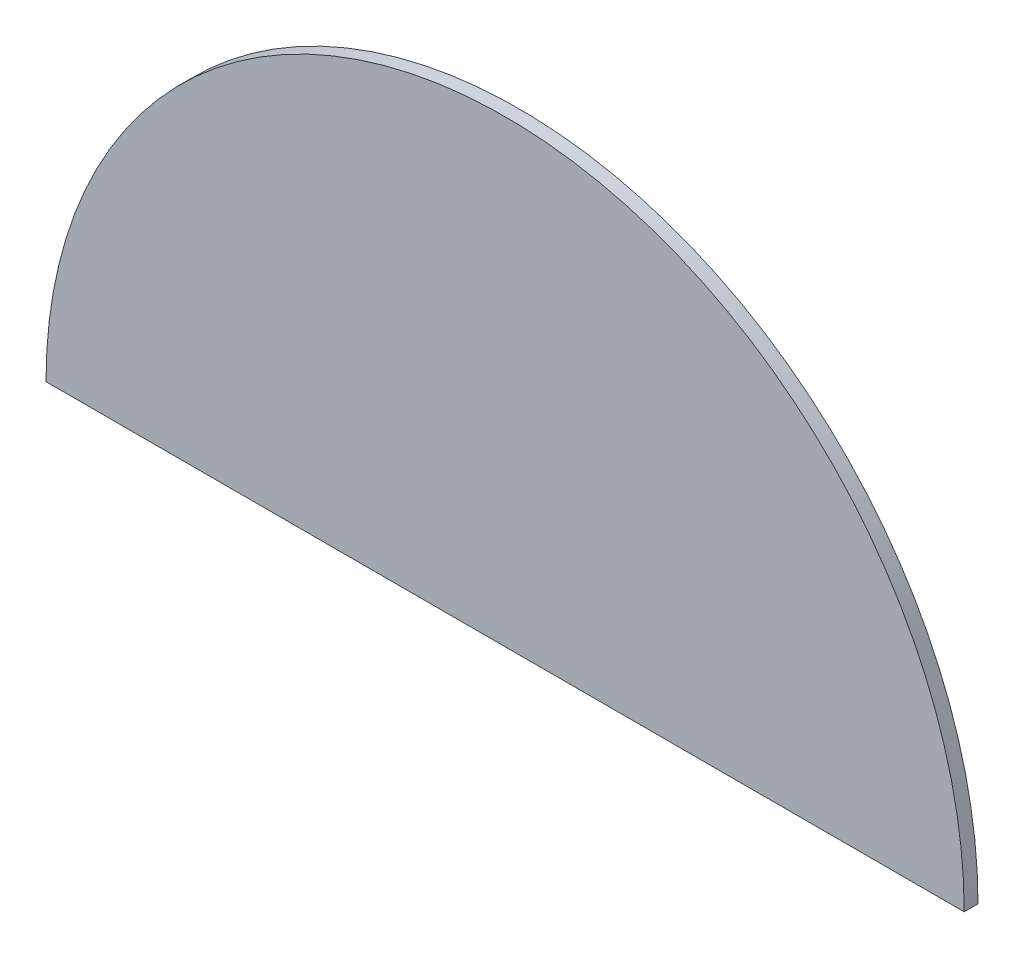
ISO-10303-21;
HEADER;
FILE_DESCRIPTION(('STEP AP214'),'2;1');
FILE_NAME('part.step','',(''),(''),'','','');
FILE_SCHEMA(('AUTOMOTIVE_DESIGN { 1 0 10303 214 1 1 1 1 }'));
ENDSEC;
DATA;
#1=APPLICATION_CONTEXT('core data for automotive mechanical design processes');
#2=APPLICATION_PROTOCOL_DEFINITION('international standard','automotive_design',2000,#1);
#3=PRODUCT_CONTEXT('',#1,'mechanical');
#4=PRODUCT('Part','Part','',(#3));
#5=PRODUCT_RELATED_PRODUCT_CATEGORY('part','',(#4));
#6=PRODUCT_DEFINITION_FORMATION('','',#4);
#7=PRODUCT_DEFINITION_CONTEXT('part definition',#1,'design');
#8=PRODUCT_DEFINITION('design','',#6,#7);
#9=PRODUCT_DEFINITION_SHAPE('','',#8);
#10=(LENGTH_UNIT() NAMED_UNIT(*) SI_UNIT(.MILLI.,.METRE.));
#11=(NAMED_UNIT(*) PLANE_ANGLE_UNIT() SI_UNIT($,.RADIAN.));
#12=(NAMED_UNIT(*) SI_UNIT($,.STERADIAN.) SOLID_ANGLE_UNIT());
#13=UNCERTAINTY_MEASURE_WITH_UNIT(LENGTH_MEASURE(1.E-05),#10,'distance_accuracy_value','');
#14=(GEOMETRIC_REPRESENTATION_CONTEXT(3) GLOBAL_UNCERTAINTY_ASSIGNED_CONTEXT((#13)) GLOBAL_UNIT_ASSIGNED_CONTEXT((#10,
#11,#12)) REPRESENTATION_CONTEXT('',''));
#15=CARTESIAN_POINT('',(0.,0.,0.));
#16=DIRECTION('',(0.,0.,1.));
#17=DIRECTION('',(1.,0.,0.));
#18=AXIS2_PLACEMENT_3D('',#15,#16,#17);
#19=CARTESIAN_POINT('',(0.,0.,3.));
#20=DIRECTION('',(0.,0.,-1.));
#21=DIRECTION('',(-1.,0.,0.));
#22=AXIS2_PLACEMENT_3D('',#19,#20,#21);
#23=CYLINDRICAL_SURFACE('',#22,100.);
#24=CARTESIAN_POINT('',(0.,0.,0.));
#25=DIRECTION('',(0.,0.,1.));
#26=DIRECTION('',(-1.,0.,0.));
#27=AXIS2_PLACEMENT_3D('',#24,#25,#26);
#28=CIRCLE('',#27,100.);
#29=CARTESIAN_POINT('',(100.,0.,0.));
#30=VERTEX_POINT('',#29);
#31=CARTESIAN_POINT('',(-100.,0.,0.));
#32=VERTEX_POINT('',#31);
#33=EDGE_CURVE('E62',#30,#32,#28,.T.);
#34=ORIENTED_EDGE('',*,*,#33,.T.);
#35=DIRECTION('',(0.,0.,-1.));
#36=VECTOR('',#35,1.);
#37=CARTESIAN_POINT('',(-100.,0.,3.));
#38=LINE('',#37,#36);
#39=CARTESIAN_POINT('',(-100.,0.,3.));
#40=VERTEX_POINT('',#39);
#41=EDGE_CURVE('E11',#40,#32,#38,.T.);
#42=ORIENTED_EDGE('',*,*,#41,.F.);
#43=CARTESIAN_POINT('',(0.,0.,3.));
#44=DIRECTION('',(0.,0.,1.));
#45=DIRECTION('',(-1.,0.,0.));
#46=AXIS2_PLACEMENT_3D('',#43,#44,#45);
#47=CIRCLE('',#46,100.);
#48=CARTESIAN_POINT('',(100.,0.,3.));
#49=VERTEX_POINT('',#48);
#50=EDGE_CURVE('E61',#49,#40,#47,.T.);
#51=ORIENTED_EDGE('',*,*,#50,.F.);
#52=DIRECTION('',(0.,0.,-1.));
#53=VECTOR('',#52,1.);
#54=CARTESIAN_POINT('',(100.,0.,3.));
#55=LINE('',#54,#53);
#56=EDGE_CURVE('E39',#49,#30,#55,.T.);
#57=ORIENTED_EDGE('',*,*,#56,.T.);
#58=EDGE_LOOP('',(#34,#42,#51,#57));
#59=FACE_BOUND('',#58,.T.);
#60=ADVANCED_FACE('F31',(#59),#23,.T.);
#61=CARTESIAN_POINT('',(-100.,0.,3.));
#62=DIRECTION('',(0.,1.,0.));
#63=DIRECTION('',(0.,0.,1.));
#64=AXIS2_PLACEMENT_3D('',#61,#62,#63);
#65=PLANE('',#64);
#66=DIRECTION('',(1.,0.,0.));
#67=VECTOR('',#66,1.);
#68=CARTESIAN_POINT('',(-100.,0.,0.));
#69=LINE('',#68,#67);
#70=EDGE_CURVE('E54',#32,#30,#69,.T.);
#71=ORIENTED_EDGE('',*,*,#70,.T.);
#72=ORIENTED_EDGE('',*,*,#56,.F.);
#73=DIRECTION('',(1.,0.,0.));
#74=VECTOR('',#73,1.);
#75=CARTESIAN_POINT('',(-100.,0.,3.));
#76=LINE('',#75,#74);
#77=EDGE_CURVE('E46',#40,#49,#76,.T.);
#78=ORIENTED_EDGE('',*,*,#77,.F.);
#79=ORIENTED_EDGE('',*,*,#41,.T.);
#80=EDGE_LOOP('',(#71,#72,#78,#79));
#81=FACE_BOUND('',#80,.T.);
#82=ADVANCED_FACE('F57',(#81),#65,.F.);
#83=CARTESIAN_POINT('',(0.,0.,3.));
#84=DIRECTION('',(0.,0.,-1.));
#85=DIRECTION('',(-1.,0.,0.));
#86=AXIS2_PLACEMENT_3D('',#83,#84,#85);
#87=PLANE('',#86);
#88=ORIENTED_EDGE('',*,*,#50,.T.);
#89=ORIENTED_EDGE('',*,*,#77,.T.);
#90=EDGE_LOOP('',(#88,#89));
#91=FACE_BOUND('',#90,.T.);
#92=ADVANCED_FACE('F69',(#91),#87,.F.);
#93=CARTESIAN_POINT('',(0.,0.,0.));
#94=DIRECTION('',(0.,0.,-1.));
#95=DIRECTION('',(-1.,0.,0.));
#96=AXIS2_PLACEMENT_3D('',#93,#94,#95);
#97=PLANE('',#96);
#98=ORIENTED_EDGE('',*,*,#33,.F.);
#99=ORIENTED_EDGE('',*,*,#70,.F.);
#100=EDGE_LOOP('',(#98,#99));
#101=FACE_BOUND('',#100,.T.);
#102=ADVANCED_FACE('F65',(#101),#97,.T.);
#103=CLOSED_SHELL('',(#60,#82,#92,#102));
#104=MANIFOLD_SOLID_BREP('B2',#103);
#105=ADVANCED_BREP_SHAPE_REPRESENTATION('',(#18,#104),#14);
#106=SHAPE_DEFINITION_REPRESENTATION(#9,#105);
ENDSEC;
END-ISO-10303-21;
